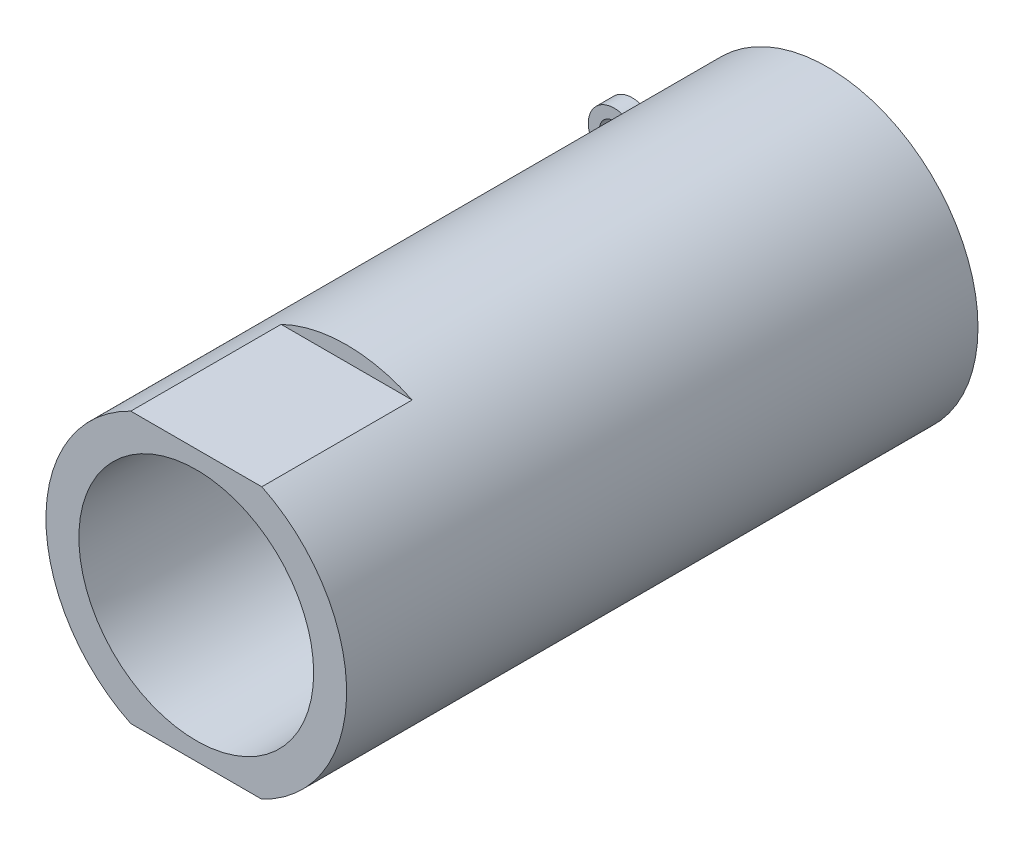
ISO-10303-21;
HEADER;
FILE_DESCRIPTION(('STEP AP214'),'2;1');
FILE_NAME('part.step','',(''),(''),'','','');
FILE_SCHEMA(('AUTOMOTIVE_DESIGN { 1 0 10303 214 1 1 1 1 }'));
ENDSEC;
DATA;
#1=APPLICATION_CONTEXT('core data for automotive mechanical design processes');
#2=APPLICATION_PROTOCOL_DEFINITION('international standard','automotive_design',2000,#1);
#3=PRODUCT_CONTEXT('',#1,'mechanical');
#4=PRODUCT('Part','Part','',(#3));
#5=PRODUCT_RELATED_PRODUCT_CATEGORY('part','',(#4));
#6=PRODUCT_DEFINITION_FORMATION('','',#4);
#7=PRODUCT_DEFINITION_CONTEXT('part definition',#1,'design');
#8=PRODUCT_DEFINITION('design','',#6,#7);
#9=PRODUCT_DEFINITION_SHAPE('','',#8);
#10=(LENGTH_UNIT() NAMED_UNIT(*) SI_UNIT(.MILLI.,.METRE.));
#11=(NAMED_UNIT(*) PLANE_ANGLE_UNIT() SI_UNIT($,.RADIAN.));
#12=(NAMED_UNIT(*) SI_UNIT($,.STERADIAN.) SOLID_ANGLE_UNIT());
#13=UNCERTAINTY_MEASURE_WITH_UNIT(LENGTH_MEASURE(1.E-05),#10,'distance_accuracy_value','');
#14=(GEOMETRIC_REPRESENTATION_CONTEXT(3) GLOBAL_UNCERTAINTY_ASSIGNED_CONTEXT((#13)) GLOBAL_UNIT_ASSIGNED_CONTEXT((#10,
#11,#12)) REPRESENTATION_CONTEXT('',''));
#15=CARTESIAN_POINT('',(0.,0.,0.));
#16=DIRECTION('',(0.,0.,1.));
#17=DIRECTION('',(1.,0.,0.));
#18=AXIS2_PLACEMENT_3D('',#15,#16,#17);
#19=CARTESIAN_POINT('',(0.,0.,42.));
#20=DIRECTION('',(0.,0.,-1.));
#21=DIRECTION('',(-1.,0.,0.));
#22=AXIS2_PLACEMENT_3D('',#19,#20,#21);
#23=CYLINDRICAL_SURFACE('',#22,10.);
#24=CARTESIAN_POINT('',(0.,0.,42.));
#25=DIRECTION('',(0.,0.,1.));
#26=DIRECTION('',(1.,0.,0.));
#27=AXIS2_PLACEMENT_3D('',#24,#25,#26);
#28=CIRCLE('',#27,10.);
#29=CARTESIAN_POINT('',(-4.35889894354068,9.,42.));
#30=VERTEX_POINT('',#29);
#31=CARTESIAN_POINT('',(-4.35889894354068,-9.,42.));
#32=VERTEX_POINT('',#31);
#33=EDGE_CURVE('E115',#30,#32,#28,.T.);
#34=ORIENTED_EDGE('',*,*,#33,.F.);
#35=DIRECTION('',(0.,0.,1.));
#36=VECTOR('',#35,1.);
#37=CARTESIAN_POINT('',(-4.35889894354068,9.,32.));
#38=LINE('',#37,#36);
#39=CARTESIAN_POINT('',(-4.35889894354068,9.,32.));
#40=VERTEX_POINT('',#39);
#41=EDGE_CURVE('E58',#40,#30,#38,.T.);
#42=ORIENTED_EDGE('',*,*,#41,.F.);
#43=CARTESIAN_POINT('',(0.,0.,32.));
#44=DIRECTION('',(0.,0.,1.));
#45=DIRECTION('',(1.,0.,0.));
#46=AXIS2_PLACEMENT_3D('',#43,#44,#45);
#47=CIRCLE('',#46,10.);
#48=CARTESIAN_POINT('',(4.35889894354068,9.,32.));
#49=VERTEX_POINT('',#48);
#50=EDGE_CURVE('E101',#49,#40,#47,.T.);
#51=ORIENTED_EDGE('',*,*,#50,.F.);
#52=DIRECTION('',(0.,0.,1.));
#53=VECTOR('',#52,1.);
#54=CARTESIAN_POINT('',(4.35889894354068,9.,32.));
#55=LINE('',#54,#53);
#56=CARTESIAN_POINT('',(4.35889894354068,9.,42.));
#57=VERTEX_POINT('',#56);
#58=EDGE_CURVE('E109',#49,#57,#55,.T.);
#59=ORIENTED_EDGE('',*,*,#58,.T.);
#60=CARTESIAN_POINT('',(4.35889894354068,-9.,42.));
#61=VERTEX_POINT('',#60);
#62=EDGE_CURVE('E169',#61,#57,#28,.T.);
#63=ORIENTED_EDGE('',*,*,#62,.F.);
#64=DIRECTION('',(0.,0.,1.));
#65=VECTOR('',#64,1.);
#66=CARTESIAN_POINT('',(4.35889894354068,-9.,32.));
#67=LINE('',#66,#65);
#68=CARTESIAN_POINT('',(4.35889894354068,-9.,32.));
#69=VERTEX_POINT('',#68);
#70=EDGE_CURVE('E50',#69,#61,#67,.T.);
#71=ORIENTED_EDGE('',*,*,#70,.F.);
#72=CARTESIAN_POINT('',(0.,0.,32.));
#73=DIRECTION('',(0.,0.,1.));
#74=DIRECTION('',(1.,0.,0.));
#75=AXIS2_PLACEMENT_3D('',#72,#73,#74);
#76=CIRCLE('',#75,10.);
#77=CARTESIAN_POINT('',(-4.35889894354068,-9.,32.));
#78=VERTEX_POINT('',#77);
#79=EDGE_CURVE('E123',#78,#69,#76,.T.);
#80=ORIENTED_EDGE('',*,*,#79,.F.);
#81=DIRECTION('',(0.,0.,1.));
#82=VECTOR('',#81,1.);
#83=CARTESIAN_POINT('',(-4.35889894354068,-9.,32.));
#84=LINE('',#83,#82);
#85=EDGE_CURVE('E127',#78,#32,#84,.T.);
#86=ORIENTED_EDGE('',*,*,#85,.T.);
#87=EDGE_LOOP('',(#34,#42,#51,#59,#63,#71,#80,#86));
#88=FACE_BOUND('',#87,.T.);
#89=CARTESIAN_POINT('',(0.,0.,0.));
#90=DIRECTION('',(0.,0.,1.));
#91=DIRECTION('',(1.,0.,0.));
#92=AXIS2_PLACEMENT_3D('',#89,#90,#91);
#93=CIRCLE('',#92,10.);
#94=CARTESIAN_POINT('',(-9.98013968974546,-0.629929974812663,0.));
#95=VERTEX_POINT('',#94);
#96=CARTESIAN_POINT('',(-9.98008290705018,0.630828953366018,0.));
#97=VERTEX_POINT('',#96);
#98=EDGE_CURVE('E168',#95,#97,#93,.T.);
#99=ORIENTED_EDGE('',*,*,#98,.T.);
#100=DIRECTION('',(0.,0.,-1.));
#101=VECTOR('',#100,1.);
#102=CARTESIAN_POINT('',(-9.98008290705018,0.630828953366018,1.2));
#103=LINE('',#102,#101);
#104=CARTESIAN_POINT('',(-9.98008290705018,0.630828953366018,1.2));
#105=VERTEX_POINT('',#104);
#106=EDGE_CURVE('E155',#105,#97,#103,.T.);
#107=ORIENTED_EDGE('',*,*,#106,.F.);
#108=CARTESIAN_POINT('',(0.,0.,1.2));
#109=DIRECTION('',(0.,0.,-1.));
#110=DIRECTION('',(-1.,0.,0.));
#111=AXIS2_PLACEMENT_3D('',#108,#109,#110);
#112=CIRCLE('',#111,10.);
#113=CARTESIAN_POINT('',(-9.98013968974546,-0.629929974812663,1.2));
#114=VERTEX_POINT('',#113);
#115=EDGE_CURVE('E173',#114,#105,#112,.T.);
#116=ORIENTED_EDGE('',*,*,#115,.F.);
#117=DIRECTION('',(0.,0.,-1.));
#118=VECTOR('',#117,1.);
#119=CARTESIAN_POINT('',(-9.98013968974546,-0.629929974812663,1.2));
#120=LINE('',#119,#118);
#121=EDGE_CURVE('E147',#114,#95,#120,.T.);
#122=ORIENTED_EDGE('',*,*,#121,.T.);
#123=EDGE_LOOP('',(#99,#107,#116,#122));
#124=FACE_BOUND('',#123,.T.);
#125=ADVANCED_FACE('F35',(#88,#124),#23,.T.);
#126=CARTESIAN_POINT('',(0.,0.,42.));
#127=DIRECTION('',(0.,0.,1.));
#128=DIRECTION('',(1.,0.,0.));
#129=AXIS2_PLACEMENT_3D('',#126,#127,#128);
#130=PLANE('',#129);
#131=DIRECTION('',(1.,0.,0.));
#132=VECTOR('',#131,1.);
#133=CARTESIAN_POINT('',(0.,9.,42.));
#134=LINE('',#133,#132);
#135=EDGE_CURVE('E106',#30,#57,#134,.T.);
#136=ORIENTED_EDGE('',*,*,#135,.F.);
#137=ORIENTED_EDGE('',*,*,#33,.T.);
#138=DIRECTION('',(1.,0.,0.));
#139=VECTOR('',#138,1.);
#140=CARTESIAN_POINT('',(0.,-9.,42.));
#141=LINE('',#140,#139);
#142=EDGE_CURVE('E124',#32,#61,#141,.T.);
#143=ORIENTED_EDGE('',*,*,#142,.T.);
#144=ORIENTED_EDGE('',*,*,#62,.T.);
#145=EDGE_LOOP('',(#136,#137,#143,#144));
#146=FACE_BOUND('',#145,.T.);
#147=CARTESIAN_POINT('',(0.,0.,42.));
#148=DIRECTION('',(0.,0.,1.));
#149=DIRECTION('',(1.,0.,0.));
#150=AXIS2_PLACEMENT_3D('',#147,#148,#149);
#151=CIRCLE('',#150,7.80856207770297);
#152=CARTESIAN_POINT('',(7.80856207770297,0.,42.));
#153=VERTEX_POINT('',#152);
#154=EDGE_CURVE('E158',#153,#153,#151,.T.);
#155=ORIENTED_EDGE('',*,*,#154,.F.);
#156=EDGE_LOOP('',(#155));
#157=FACE_BOUND('',#156,.T.);
#158=ADVANCED_FACE('F191',(#146,#157),#130,.T.);
#159=CARTESIAN_POINT('',(0.,0.,-0.001000000000001));
#160=DIRECTION('',(0.,0.,1.));
#161=DIRECTION('',(1.,0.,0.));
#162=AXIS2_PLACEMENT_3D('',#159,#160,#161);
#163=CYLINDRICAL_SURFACE('',#162,5.25);
#164=CARTESIAN_POINT('',(0.,0.,11.));
#165=DIRECTION('',(0.,0.,1.));
#166=DIRECTION('',(1.,0.,0.));
#167=AXIS2_PLACEMENT_3D('',#164,#165,#166);
#168=CIRCLE('',#167,5.25);
#169=CARTESIAN_POINT('',(5.25,0.,11.));
#170=VERTEX_POINT('',#169);
#171=EDGE_CURVE('E12',#170,#170,#168,.T.);
#172=ORIENTED_EDGE('',*,*,#171,.T.);
#173=EDGE_LOOP('',(#172));
#174=FACE_BOUND('',#173,.T.);
#175=CARTESIAN_POINT('',(0.,0.,0.));
#176=DIRECTION('',(0.,0.,1.));
#177=DIRECTION('',(1.,0.,0.));
#178=AXIS2_PLACEMENT_3D('',#175,#176,#177);
#179=CIRCLE('',#178,5.25);
#180=CARTESIAN_POINT('',(5.25,0.,0.));
#181=VERTEX_POINT('',#180);
#182=EDGE_CURVE('E165',#181,#181,#179,.F.);
#183=ORIENTED_EDGE('',*,*,#182,.T.);
#184=EDGE_LOOP('',(#183));
#185=FACE_BOUND('',#184,.T.);
#186=ADVANCED_FACE('F196',(#174,#185),#163,.F.);
#187=CARTESIAN_POINT('',(0.,0.,0.));
#188=DIRECTION('',(0.,0.,1.));
#189=DIRECTION('',(1.,0.,0.));
#190=AXIS2_PLACEMENT_3D('',#187,#188,#189);
#191=PLANE('',#190);
#192=ORIENTED_EDGE('',*,*,#182,.F.);
#193=EDGE_LOOP('',(#192));
#194=FACE_BOUND('',#193,.T.);
#195=ORIENTED_EDGE('',*,*,#98,.F.);
#196=DIRECTION('',(-1.,0.,0.));
#197=VECTOR('',#196,1.);
#198=CARTESIAN_POINT('',(-9.98013968974546,-0.629929974812663,0.));
#199=LINE('',#198,#197);
#200=CARTESIAN_POINT('',(-11.3721783561325,-0.629929974812663,0.));
#201=VERTEX_POINT('',#200);
#202=EDGE_CURVE('E134',#95,#201,#199,.T.);
#203=ORIENTED_EDGE('',*,*,#202,.T.);
#204=CARTESIAN_POINT('',(-12.9878339924766,0.00052225726725866,0.));
#205=DIRECTION('',(0.,0.,-1.));
#206=DIRECTION('',(1.,0.,0.));
#207=AXIS2_PLACEMENT_3D('',#204,#205,#206);
#208=CIRCLE('',#207,1.73430480371388);
#209=CARTESIAN_POINT('',(-11.3721215734372,0.630828953366018,0.));
#210=VERTEX_POINT('',#209);
#211=EDGE_CURVE('E150',#201,#210,#208,.T.);
#212=ORIENTED_EDGE('',*,*,#211,.T.);
#213=DIRECTION('',(1.,0.,0.));
#214=VECTOR('',#213,1.);
#215=CARTESIAN_POINT('',(-9.98008290705018,0.630828953366018,0.));
#216=LINE('',#215,#214);
#217=EDGE_CURVE('E141',#210,#97,#216,.T.);
#218=ORIENTED_EDGE('',*,*,#217,.T.);
#219=EDGE_LOOP('',(#195,#203,#212,#218));
#220=FACE_BOUND('',#219,.T.);
#221=CARTESIAN_POINT('',(-12.9878339924766,0.00052225726725866,0.));
#222=DIRECTION('',(0.,0.,-1.));
#223=DIRECTION('',(-1.,0.,0.));
#224=AXIS2_PLACEMENT_3D('',#221,#222,#223);
#225=CIRCLE('',#224,1.);
#226=CARTESIAN_POINT('',(-13.9878339924766,0.00052225726725866,0.));
#227=VERTEX_POINT('',#226);
#228=EDGE_CURVE('E117',#227,#227,#225,.T.);
#229=ORIENTED_EDGE('',*,*,#228,.F.);
#230=EDGE_LOOP('',(#229));
#231=FACE_BOUND('',#230,.T.);
#232=ADVANCED_FACE('F200',(#194,#220,#231),#191,.F.);
#233=CARTESIAN_POINT('',(0.,0.,10.));
#234=DIRECTION('',(0.,0.,1.));
#235=DIRECTION('',(1.,0.,0.));
#236=AXIS2_PLACEMENT_3D('',#233,#234,#235);
#237=CONICAL_SURFACE('',#236,7.25,0.0174532925199433);
#238=CARTESIAN_POINT('',(0.,0.,13.0532954706859));
#239=DIRECTION('',(0.,0.,-1.));
#240=DIRECTION('',(-1.,0.,0.));
#241=AXIS2_PLACEMENT_3D('',#238,#239,#240);
#242=CIRCLE('',#241,7.30329547068586);
#243=CARTESIAN_POINT('',(-7.30329547068586,0.,13.0532954706859));
#244=VERTEX_POINT('',#243);
#245=EDGE_CURVE('E43',#244,#244,#242,.T.);
#246=ORIENTED_EDGE('',*,*,#245,.T.);
#247=EDGE_LOOP('',(#246));
#248=FACE_BOUND('',#247,.T.);
#249=ORIENTED_EDGE('',*,*,#154,.T.);
#250=EDGE_LOOP('',(#249));
#251=FACE_BOUND('',#250,.T.);
#252=ADVANCED_FACE('F180',(#248,#251),#237,.F.);
#253=CARTESIAN_POINT('',(-9.98008290705018,0.630828953366018,1.2));
#254=DIRECTION('',(0.,1.,0.));
#255=DIRECTION('',(0.,0.,1.));
#256=AXIS2_PLACEMENT_3D('',#253,#254,#255);
#257=PLANE('',#256);
#258=ORIENTED_EDGE('',*,*,#217,.F.);
#259=DIRECTION('',(0.,0.,-1.));
#260=VECTOR('',#259,1.);
#261=CARTESIAN_POINT('',(-11.3721215734372,0.630828953366018,1.2));
#262=LINE('',#261,#260);
#263=CARTESIAN_POINT('',(-11.3721215734372,0.630828953366018,1.2));
#264=VERTEX_POINT('',#263);
#265=EDGE_CURVE('E159',#264,#210,#262,.T.);
#266=ORIENTED_EDGE('',*,*,#265,.F.);
#267=DIRECTION('',(1.,0.,0.));
#268=VECTOR('',#267,1.);
#269=CARTESIAN_POINT('',(-9.98008290705018,0.630828953366018,1.2));
#270=LINE('',#269,#268);
#271=EDGE_CURVE('E144',#264,#105,#270,.T.);
#272=ORIENTED_EDGE('',*,*,#271,.T.);
#273=ORIENTED_EDGE('',*,*,#106,.T.);
#274=EDGE_LOOP('',(#258,#266,#272,#273));
#275=FACE_BOUND('',#274,.T.);
#276=ADVANCED_FACE('F202',(#275),#257,.T.);
#277=CARTESIAN_POINT('',(-12.9878339924766,0.00052225726725866,1.2));
#278=DIRECTION('',(0.,0.,-1.));
#279=DIRECTION('',(-1.,0.,0.));
#280=AXIS2_PLACEMENT_3D('',#277,#278,#279);
#281=CYLINDRICAL_SURFACE('',#280,1.73430480371388);
#282=ORIENTED_EDGE('',*,*,#211,.F.);
#283=DIRECTION('',(0.,0.,-1.));
#284=VECTOR('',#283,1.);
#285=CARTESIAN_POINT('',(-11.3721783561325,-0.629929974812663,1.2));
#286=LINE('',#285,#284);
#287=CARTESIAN_POINT('',(-11.3721783561325,-0.629929974812663,1.2));
#288=VERTEX_POINT('',#287);
#289=EDGE_CURVE('E161',#288,#201,#286,.T.);
#290=ORIENTED_EDGE('',*,*,#289,.F.);
#291=CARTESIAN_POINT('',(-12.9878339924766,0.00052225726725866,1.2));
#292=DIRECTION('',(0.,0.,-1.));
#293=DIRECTION('',(1.,0.,0.));
#294=AXIS2_PLACEMENT_3D('',#291,#292,#293);
#295=CIRCLE('',#294,1.73430480371388);
#296=EDGE_CURVE('E140',#288,#264,#295,.T.);
#297=ORIENTED_EDGE('',*,*,#296,.T.);
#298=ORIENTED_EDGE('',*,*,#265,.T.);
#299=EDGE_LOOP('',(#282,#290,#297,#298));
#300=FACE_BOUND('',#299,.T.);
#301=ADVANCED_FACE('F207',(#300),#281,.T.);
#302=CARTESIAN_POINT('',(-9.98013968974546,-0.629929974812663,1.2));
#303=DIRECTION('',(0.,-1.,0.));
#304=DIRECTION('',(0.,0.,-1.));
#305=AXIS2_PLACEMENT_3D('',#302,#303,#304);
#306=PLANE('',#305);
#307=ORIENTED_EDGE('',*,*,#202,.F.);
#308=ORIENTED_EDGE('',*,*,#121,.F.);
#309=DIRECTION('',(-1.,0.,0.));
#310=VECTOR('',#309,1.);
#311=CARTESIAN_POINT('',(-9.98013968974546,-0.629929974812663,1.2));
#312=LINE('',#311,#310);
#313=EDGE_CURVE('E137',#114,#288,#312,.T.);
#314=ORIENTED_EDGE('',*,*,#313,.T.);
#315=ORIENTED_EDGE('',*,*,#289,.T.);
#316=EDGE_LOOP('',(#307,#308,#314,#315));
#317=FACE_BOUND('',#316,.T.);
#318=ADVANCED_FACE('F233',(#317),#306,.T.);
#319=CARTESIAN_POINT('',(0.,0.,1.2));
#320=DIRECTION('',(0.,0.,-1.));
#321=DIRECTION('',(-1.,0.,0.));
#322=AXIS2_PLACEMENT_3D('',#319,#320,#321);
#323=PLANE('',#322);
#324=CARTESIAN_POINT('',(-12.9878339924766,0.00052225726725866,1.2));
#325=DIRECTION('',(0.,0.,-1.));
#326=DIRECTION('',(-1.,0.,0.));
#327=AXIS2_PLACEMENT_3D('',#324,#325,#326);
#328=CIRCLE('',#327,1.);
#329=CARTESIAN_POINT('',(-13.9878339924766,0.00052225726725866,1.2));
#330=VERTEX_POINT('',#329);
#331=EDGE_CURVE('E131',#330,#330,#328,.T.);
#332=ORIENTED_EDGE('',*,*,#331,.T.);
#333=EDGE_LOOP('',(#332));
#334=FACE_BOUND('',#333,.T.);
#335=ORIENTED_EDGE('',*,*,#313,.F.);
#336=ORIENTED_EDGE('',*,*,#115,.T.);
#337=ORIENTED_EDGE('',*,*,#271,.F.);
#338=ORIENTED_EDGE('',*,*,#296,.F.);
#339=EDGE_LOOP('',(#335,#336,#337,#338));
#340=FACE_BOUND('',#339,.T.);
#341=ADVANCED_FACE('F224',(#334,#340),#323,.F.);
#342=CARTESIAN_POINT('',(-12.9878339924766,0.00052225726725866,1.2));
#343=DIRECTION('',(0.,0.,-1.));
#344=DIRECTION('',(-1.,0.,0.));
#345=AXIS2_PLACEMENT_3D('',#342,#343,#344);
#346=CYLINDRICAL_SURFACE('',#345,1.);
#347=ORIENTED_EDGE('',*,*,#331,.F.);
#348=EDGE_LOOP('',(#347));
#349=FACE_BOUND('',#348,.T.);
#350=ORIENTED_EDGE('',*,*,#228,.T.);
#351=EDGE_LOOP('',(#350));
#352=FACE_BOUND('',#351,.T.);
#353=ADVANCED_FACE('F221',(#349,#352),#346,.F.);
#354=CARTESIAN_POINT('',(0.,-9.,32.));
#355=DIRECTION('',(0.,-1.,0.));
#356=DIRECTION('',(0.,0.,-1.));
#357=AXIS2_PLACEMENT_3D('',#354,#355,#356);
#358=PLANE('',#357);
#359=ORIENTED_EDGE('',*,*,#142,.F.);
#360=ORIENTED_EDGE('',*,*,#85,.F.);
#361=DIRECTION('',(1.,0.,0.));
#362=VECTOR('',#361,1.);
#363=CARTESIAN_POINT('',(0.,-9.,32.));
#364=LINE('',#363,#362);
#365=EDGE_CURVE('E121',#78,#69,#364,.T.);
#366=ORIENTED_EDGE('',*,*,#365,.T.);
#367=ORIENTED_EDGE('',*,*,#70,.T.);
#368=EDGE_LOOP('',(#359,#360,#366,#367));
#369=FACE_BOUND('',#368,.T.);
#370=ADVANCED_FACE('F223',(#369),#358,.T.);
#371=CARTESIAN_POINT('',(0.,0.,32.));
#372=DIRECTION('',(0.,0.,1.));
#373=DIRECTION('',(1.,0.,0.));
#374=AXIS2_PLACEMENT_3D('',#371,#372,#373);
#375=PLANE('',#374);
#376=ORIENTED_EDGE('',*,*,#365,.F.);
#377=ORIENTED_EDGE('',*,*,#79,.T.);
#378=EDGE_LOOP('',(#376,#377));
#379=FACE_BOUND('',#378,.T.);
#380=ADVANCED_FACE('F231',(#379),#375,.T.);
#381=CARTESIAN_POINT('',(0.,9.,32.));
#382=DIRECTION('',(0.,-1.,0.));
#383=DIRECTION('',(0.,0.,-1.));
#384=AXIS2_PLACEMENT_3D('',#381,#382,#383);
#385=PLANE('',#384);
#386=ORIENTED_EDGE('',*,*,#135,.T.);
#387=ORIENTED_EDGE('',*,*,#58,.F.);
#388=DIRECTION('',(1.,0.,0.));
#389=VECTOR('',#388,1.);
#390=CARTESIAN_POINT('',(0.,9.,32.));
#391=LINE('',#390,#389);
#392=EDGE_CURVE('E103',#40,#49,#391,.T.);
#393=ORIENTED_EDGE('',*,*,#392,.F.);
#394=ORIENTED_EDGE('',*,*,#41,.T.);
#395=EDGE_LOOP('',(#386,#387,#393,#394));
#396=FACE_BOUND('',#395,.T.);
#397=ADVANCED_FACE('F108',(#396),#385,.F.);
#398=CARTESIAN_POINT('',(0.,0.,32.));
#399=DIRECTION('',(0.,0.,1.));
#400=DIRECTION('',(1.,0.,0.));
#401=AXIS2_PLACEMENT_3D('',#398,#399,#400);
#402=PLANE('',#401);
#403=ORIENTED_EDGE('',*,*,#50,.T.);
#404=ORIENTED_EDGE('',*,*,#392,.T.);
#405=EDGE_LOOP('',(#403,#404));
#406=FACE_BOUND('',#405,.T.);
#407=ADVANCED_FACE('F102',(#406),#402,.T.);
#408=CARTESIAN_POINT('',(0.,0.,13.0532954706859));
#409=DIRECTION('',(0.,0.,1.));
#410=DIRECTION('',(1.,0.,0.));
#411=AXIS2_PLACEMENT_3D('',#408,#409,#410);
#412=CONICAL_SURFACE('',#411,7.30329547068586,0.785398163397443);
#413=ORIENTED_EDGE('',*,*,#171,.F.);
#414=EDGE_LOOP('',(#413));
#415=FACE_BOUND('',#414,.T.);
#416=ORIENTED_EDGE('',*,*,#245,.F.);
#417=EDGE_LOOP('',(#416));
#418=FACE_BOUND('',#417,.T.);
#419=ADVANCED_FACE('F37',(#415,#418),#412,.F.);
#420=CLOSED_SHELL('',(#125,#158,#186,#232,#252,#276,#301,#318,#341,#353,#370,#380,#397,#407,#419));
#421=MANIFOLD_SOLID_BREP('B2',#420);
#422=ADVANCED_BREP_SHAPE_REPRESENTATION('',(#18,#421),#14);
#423=SHAPE_DEFINITION_REPRESENTATION(#9,#422);
ENDSEC;
END-ISO-10303-21;
